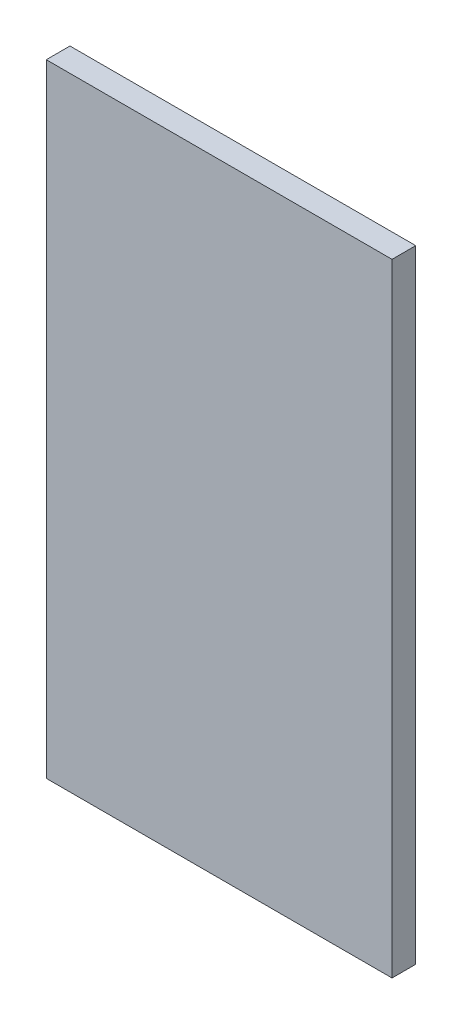
ISO-10303-21;
HEADER;
FILE_DESCRIPTION(('STEP AP214'),'2;1');
FILE_NAME('part.step','',(''),(''),'','','');
FILE_SCHEMA(('AUTOMOTIVE_DESIGN { 1 0 10303 214 1 1 1 1 }'));
ENDSEC;
DATA;
#1=APPLICATION_CONTEXT('core data for automotive mechanical design processes');
#2=APPLICATION_PROTOCOL_DEFINITION('international standard','automotive_design',2000,#1);
#3=PRODUCT_CONTEXT('',#1,'mechanical');
#4=PRODUCT('Part','Part','',(#3));
#5=PRODUCT_RELATED_PRODUCT_CATEGORY('part','',(#4));
#6=PRODUCT_DEFINITION_FORMATION('','',#4);
#7=PRODUCT_DEFINITION_CONTEXT('part definition',#1,'design');
#8=PRODUCT_DEFINITION('design','',#6,#7);
#9=PRODUCT_DEFINITION_SHAPE('','',#8);
#10=(LENGTH_UNIT() NAMED_UNIT(*) SI_UNIT(.MILLI.,.METRE.));
#11=(NAMED_UNIT(*) PLANE_ANGLE_UNIT() SI_UNIT($,.RADIAN.));
#12=(NAMED_UNIT(*) SI_UNIT($,.STERADIAN.) SOLID_ANGLE_UNIT());
#13=UNCERTAINTY_MEASURE_WITH_UNIT(LENGTH_MEASURE(1.E-05),#10,'distance_accuracy_value','');
#14=(GEOMETRIC_REPRESENTATION_CONTEXT(3) GLOBAL_UNCERTAINTY_ASSIGNED_CONTEXT((#13)) GLOBAL_UNIT_ASSIGNED_CONTEXT((#10,
#11,#12)) REPRESENTATION_CONTEXT('',''));
#15=CARTESIAN_POINT('',(0.,0.,0.));
#16=DIRECTION('',(0.,0.,1.));
#17=DIRECTION('',(1.,0.,0.));
#18=AXIS2_PLACEMENT_3D('',#15,#16,#17);
#19=CARTESIAN_POINT('',(9.00008,0.7,0.));
#20=DIRECTION('',(0.,0.,-1.));
#21=DIRECTION('',(-1.,0.,0.));
#22=AXIS2_PLACEMENT_3D('',#19,#20,#21);
#23=PLANE('',#22);
#24=DIRECTION('',(1.,0.,0.));
#25=VECTOR('',#24,1.);
#26=CARTESIAN_POINT('',(8.75008,1.15,0.));
#27=LINE('',#26,#25);
#28=CARTESIAN_POINT('',(8.75008,1.15,0.));
#29=VERTEX_POINT('',#28);
#30=CARTESIAN_POINT('',(9.25008,1.15,0.));
#31=VERTEX_POINT('',#30);
#32=EDGE_CURVE('E55',#29,#31,#27,.T.);
#33=ORIENTED_EDGE('',*,*,#32,.T.);
#34=DIRECTION('',(0.,1.,0.));
#35=VECTOR('',#34,1.);
#36=CARTESIAN_POINT('',(9.25008,1.15,0.));
#37=LINE('',#36,#35);
#38=CARTESIAN_POINT('',(9.25008,0.25,0.));
#39=VERTEX_POINT('',#38);
#40=EDGE_CURVE('E57',#31,#39,#37,.F.);
#41=ORIENTED_EDGE('',*,*,#40,.T.);
#42=DIRECTION('',(1.,0.,0.));
#43=VECTOR('',#42,1.);
#44=CARTESIAN_POINT('',(9.25008,0.25,0.));
#45=LINE('',#44,#43);
#46=CARTESIAN_POINT('',(8.75008,0.25,0.));
#47=VERTEX_POINT('',#46);
#48=EDGE_CURVE('E20',#39,#47,#45,.F.);
#49=ORIENTED_EDGE('',*,*,#48,.T.);
#50=DIRECTION('',(0.,1.,0.));
#51=VECTOR('',#50,1.);
#52=CARTESIAN_POINT('',(8.75008,0.25,0.));
#53=LINE('',#52,#51);
#54=EDGE_CURVE('E80',#47,#29,#53,.T.);
#55=ORIENTED_EDGE('',*,*,#54,.T.);
#56=EDGE_LOOP('',(#33,#41,#49,#55));
#57=FACE_BOUND('',#56,.T.);
#58=ADVANCED_FACE('F17',(#57),#23,.T.);
#59=CARTESIAN_POINT('',(9.25008,0.25,0.));
#60=DIRECTION('',(0.,1.,0.));
#61=DIRECTION('',(0.,0.,1.));
#62=AXIS2_PLACEMENT_3D('',#59,#60,#61);
#63=PLANE('',#62);
#64=DIRECTION('',(0.,0.,-1.));
#65=VECTOR('',#64,1.);
#66=CARTESIAN_POINT('',(8.75008,0.25,0.));
#67=LINE('',#66,#65);
#68=CARTESIAN_POINT('',(8.75008,0.25,0.03429));
#69=VERTEX_POINT('',#68);
#70=EDGE_CURVE('E68',#69,#47,#67,.T.);
#71=ORIENTED_EDGE('',*,*,#70,.T.);
#72=ORIENTED_EDGE('',*,*,#48,.F.);
#73=DIRECTION('',(0.,0.,1.));
#74=VECTOR('',#73,1.);
#75=CARTESIAN_POINT('',(9.25008,0.25,0.));
#76=LINE('',#75,#74);
#77=CARTESIAN_POINT('',(9.25008,0.25,0.03429));
#78=VERTEX_POINT('',#77);
#79=EDGE_CURVE('E63',#39,#78,#76,.T.);
#80=ORIENTED_EDGE('',*,*,#79,.T.);
#81=DIRECTION('',(1.,0.,0.));
#82=VECTOR('',#81,1.);
#83=CARTESIAN_POINT('',(9.00008,0.25,0.03429));
#84=LINE('',#83,#82);
#85=EDGE_CURVE('E83',#69,#78,#84,.T.);
#86=ORIENTED_EDGE('',*,*,#85,.F.);
#87=EDGE_LOOP('',(#71,#72,#80,#86));
#88=FACE_BOUND('',#87,.T.);
#89=ADVANCED_FACE('F65',(#88),#63,.F.);
#90=CARTESIAN_POINT('',(9.25008,1.15,0.));
#91=DIRECTION('',(-1.,0.,0.));
#92=DIRECTION('',(0.,0.,1.));
#93=AXIS2_PLACEMENT_3D('',#90,#91,#92);
#94=PLANE('',#93);
#95=ORIENTED_EDGE('',*,*,#79,.F.);
#96=ORIENTED_EDGE('',*,*,#40,.F.);
#97=DIRECTION('',(0.,0.,-1.));
#98=VECTOR('',#97,1.);
#99=CARTESIAN_POINT('',(9.25008,1.15,0.));
#100=LINE('',#99,#98);
#101=CARTESIAN_POINT('',(9.25008,1.15,0.03429));
#102=VERTEX_POINT('',#101);
#103=EDGE_CURVE('E75',#31,#102,#100,.F.);
#104=ORIENTED_EDGE('',*,*,#103,.T.);
#105=DIRECTION('',(0.,1.,0.));
#106=VECTOR('',#105,1.);
#107=CARTESIAN_POINT('',(9.25008,0.7,0.03429));
#108=LINE('',#107,#106);
#109=EDGE_CURVE('E72',#78,#102,#108,.T.);
#110=ORIENTED_EDGE('',*,*,#109,.F.);
#111=EDGE_LOOP('',(#95,#96,#104,#110));
#112=FACE_BOUND('',#111,.T.);
#113=ADVANCED_FACE('F70',(#112),#94,.F.);
#114=CARTESIAN_POINT('',(8.75008,1.15,0.));
#115=DIRECTION('',(0.,-1.,0.));
#116=DIRECTION('',(0.,0.,-1.));
#117=AXIS2_PLACEMENT_3D('',#114,#115,#116);
#118=PLANE('',#117);
#119=ORIENTED_EDGE('',*,*,#103,.F.);
#120=ORIENTED_EDGE('',*,*,#32,.F.);
#121=DIRECTION('',(0.,0.,-1.));
#122=VECTOR('',#121,1.);
#123=CARTESIAN_POINT('',(8.75008,1.15,0.));
#124=LINE('',#123,#122);
#125=CARTESIAN_POINT('',(8.75008,1.15,0.03429));
#126=VERTEX_POINT('',#125);
#127=EDGE_CURVE('E35',#29,#126,#124,.F.);
#128=ORIENTED_EDGE('',*,*,#127,.T.);
#129=DIRECTION('',(1.,0.,0.));
#130=VECTOR('',#129,1.);
#131=CARTESIAN_POINT('',(9.00008,1.15,0.03429));
#132=LINE('',#131,#130);
#133=EDGE_CURVE('E26',#102,#126,#132,.F.);
#134=ORIENTED_EDGE('',*,*,#133,.F.);
#135=EDGE_LOOP('',(#119,#120,#128,#134));
#136=FACE_BOUND('',#135,.T.);
#137=ADVANCED_FACE('F89',(#136),#118,.F.);
#138=CARTESIAN_POINT('',(8.75008,0.25,0.));
#139=DIRECTION('',(1.,0.,0.));
#140=DIRECTION('',(0.,0.,-1.));
#141=AXIS2_PLACEMENT_3D('',#138,#139,#140);
#142=PLANE('',#141);
#143=ORIENTED_EDGE('',*,*,#127,.F.);
#144=ORIENTED_EDGE('',*,*,#54,.F.);
#145=ORIENTED_EDGE('',*,*,#70,.F.);
#146=DIRECTION('',(0.,1.,0.));
#147=VECTOR('',#146,1.);
#148=CARTESIAN_POINT('',(8.75008,0.7,0.03429));
#149=LINE('',#148,#147);
#150=EDGE_CURVE('E11',#126,#69,#149,.F.);
#151=ORIENTED_EDGE('',*,*,#150,.F.);
#152=EDGE_LOOP('',(#143,#144,#145,#151));
#153=FACE_BOUND('',#152,.T.);
#154=ADVANCED_FACE('F91',(#153),#142,.F.);
#155=CARTESIAN_POINT('',(9.00008,0.7,0.03429));
#156=DIRECTION('',(0.,0.,1.));
#157=DIRECTION('',(1.,0.,0.));
#158=AXIS2_PLACEMENT_3D('',#155,#156,#157);
#159=PLANE('',#158);
#160=ORIENTED_EDGE('',*,*,#133,.T.);
#161=ORIENTED_EDGE('',*,*,#150,.T.);
#162=ORIENTED_EDGE('',*,*,#85,.T.);
#163=ORIENTED_EDGE('',*,*,#109,.T.);
#164=EDGE_LOOP('',(#160,#161,#162,#163));
#165=FACE_BOUND('',#164,.T.);
#166=ADVANCED_FACE('F88',(#165),#159,.T.);
#167=CLOSED_SHELL('',(#58,#89,#113,#137,#154,#166));
#168=MANIFOLD_SOLID_BREP('B1',#167);
#169=ADVANCED_BREP_SHAPE_REPRESENTATION('',(#18,#168),#14);
#170=SHAPE_DEFINITION_REPRESENTATION(#9,#169);
ENDSEC;
END-ISO-10303-21;
